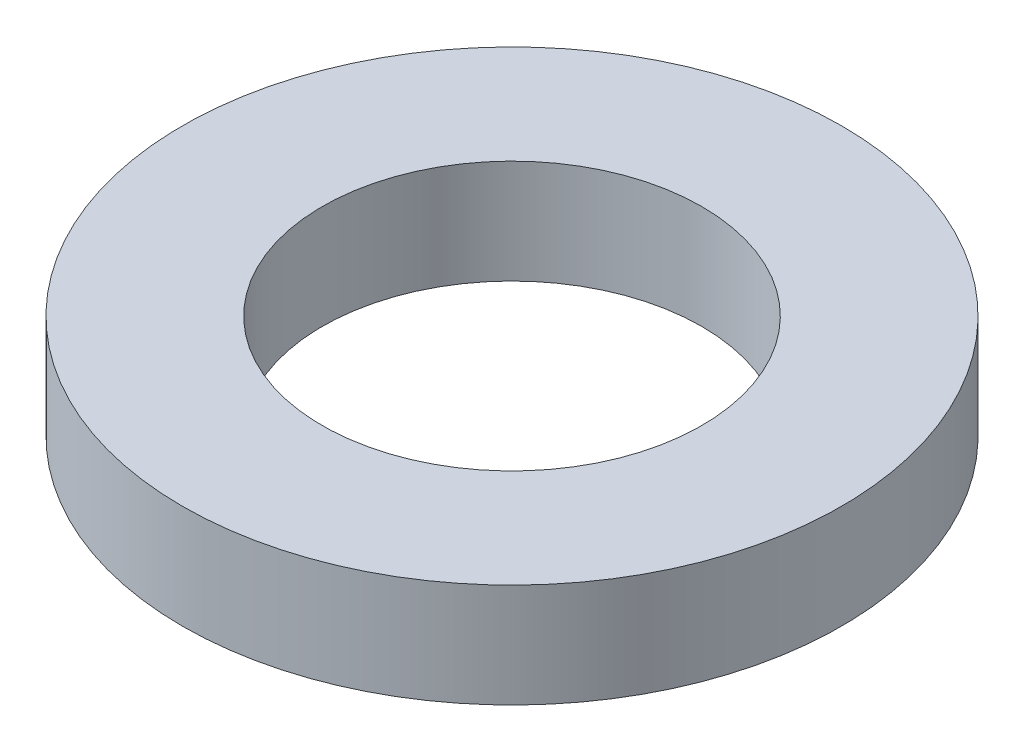
ISO-10303-21;
HEADER;
FILE_DESCRIPTION(('STEP AP214'),'2;1');
FILE_NAME('part.step','',(''),(''),'','','');
FILE_SCHEMA(('AUTOMOTIVE_DESIGN { 1 0 10303 214 1 1 1 1 }'));
ENDSEC;
DATA;
#1=APPLICATION_CONTEXT('core data for automotive mechanical design processes');
#2=APPLICATION_PROTOCOL_DEFINITION('international standard','automotive_design',2000,#1);
#3=PRODUCT_CONTEXT('',#1,'mechanical');
#4=PRODUCT('Part','Part','',(#3));
#5=PRODUCT_RELATED_PRODUCT_CATEGORY('part','',(#4));
#6=PRODUCT_DEFINITION_FORMATION('','',#4);
#7=PRODUCT_DEFINITION_CONTEXT('part definition',#1,'design');
#8=PRODUCT_DEFINITION('design','',#6,#7);
#9=PRODUCT_DEFINITION_SHAPE('','',#8);
#10=(LENGTH_UNIT() NAMED_UNIT(*) SI_UNIT(.MILLI.,.METRE.));
#11=(NAMED_UNIT(*) PLANE_ANGLE_UNIT() SI_UNIT($,.RADIAN.));
#12=(NAMED_UNIT(*) SI_UNIT($,.STERADIAN.) SOLID_ANGLE_UNIT());
#13=UNCERTAINTY_MEASURE_WITH_UNIT(LENGTH_MEASURE(1.E-05),#10,'distance_accuracy_value','');
#14=(GEOMETRIC_REPRESENTATION_CONTEXT(3) GLOBAL_UNCERTAINTY_ASSIGNED_CONTEXT((#13)) GLOBAL_UNIT_ASSIGNED_CONTEXT((#10,
#11,#12)) REPRESENTATION_CONTEXT('',''));
#15=CARTESIAN_POINT('',(0.,0.,0.));
#16=DIRECTION('',(0.,0.,1.));
#17=DIRECTION('',(1.,0.,0.));
#18=AXIS2_PLACEMENT_3D('',#15,#16,#17);
#19=CARTESIAN_POINT('',(0.,26.,0.));
#20=DIRECTION('',(0.,-1.,0.));
#21=DIRECTION('',(0.,0.,-1.));
#22=AXIS2_PLACEMENT_3D('',#19,#20,#21);
#23=CYLINDRICAL_SURFACE('',#22,82.5);
#24=CARTESIAN_POINT('',(0.,26.,0.));
#25=DIRECTION('',(0.,1.,0.));
#26=DIRECTION('',(0.,0.,1.));
#27=AXIS2_PLACEMENT_3D('',#24,#25,#26);
#28=CIRCLE('',#27,82.5);
#29=CARTESIAN_POINT('',(0.,26.,-82.5));
#30=VERTEX_POINT('',#29);
#31=EDGE_CURVE('E10',#30,#30,#28,.T.);
#32=CARTESIAN_POINT('',(0.,0.,0.));
#33=DIRECTION('',(0.,1.,0.));
#34=DIRECTION('',(0.,0.,1.));
#35=AXIS2_PLACEMENT_3D('',#32,#33,#34);
#36=CIRCLE('',#35,82.5);
#37=CARTESIAN_POINT('',(0.,0.,-82.5));
#38=VERTEX_POINT('',#37);
#39=EDGE_CURVE('E37',#38,#38,#36,.T.);
#40=CARTESIAN_POINT('',(0.,26.,-82.5));
#41=CARTESIAN_POINT('',(0.,25.7291666666667,-82.5));
#42=CARTESIAN_POINT('',(0.,25.4583333333333,-82.5));
#43=CARTESIAN_POINT('',(0.,24.9166666666667,-82.5));
#44=CARTESIAN_POINT('',(0.,24.6458333333333,-82.5));
#45=CARTESIAN_POINT('',(0.,24.1041666666667,-82.5));
#46=CARTESIAN_POINT('',(0.,23.8333333333333,-82.5));
#47=CARTESIAN_POINT('',(0.,23.2916666666667,-82.5));
#48=CARTESIAN_POINT('',(0.,23.0208333333333,-82.5));
#49=CARTESIAN_POINT('',(0.,22.4791666666667,-82.5));
#50=CARTESIAN_POINT('',(0.,22.2083333333333,-82.5));
#51=CARTESIAN_POINT('',(0.,21.6666666666667,-82.5));
#52=CARTESIAN_POINT('',(0.,21.3958333333333,-82.5));
#53=CARTESIAN_POINT('',(0.,20.8541666666667,-82.5));
#54=CARTESIAN_POINT('',(0.,20.5833333333333,-82.5));
#55=CARTESIAN_POINT('',(0.,20.0416666666667,-82.5));
#56=CARTESIAN_POINT('',(0.,19.7708333333333,-82.5));
#57=CARTESIAN_POINT('',(0.,19.2291666666667,-82.5));
#58=CARTESIAN_POINT('',(0.,18.9583333333333,-82.5));
#59=CARTESIAN_POINT('',(0.,18.4166666666667,-82.5));
#60=CARTESIAN_POINT('',(0.,18.1458333333333,-82.5));
#61=CARTESIAN_POINT('',(0.,17.6041666666667,-82.5));
#62=CARTESIAN_POINT('',(0.,17.3333333333333,-82.5));
#63=CARTESIAN_POINT('',(0.,16.7916666666667,-82.5));
#64=CARTESIAN_POINT('',(0.,16.5208333333333,-82.5));
#65=CARTESIAN_POINT('',(0.,15.9791666666667,-82.5));
#66=CARTESIAN_POINT('',(0.,15.7083333333333,-82.5));
#67=CARTESIAN_POINT('',(0.,15.1666666666667,-82.5));
#68=CARTESIAN_POINT('',(0.,14.8958333333333,-82.5));
#69=CARTESIAN_POINT('',(0.,14.3541666666667,-82.5));
#70=CARTESIAN_POINT('',(0.,14.0833333333333,-82.5));
#71=CARTESIAN_POINT('',(0.,13.5416666666667,-82.5));
#72=CARTESIAN_POINT('',(0.,13.2708333333333,-82.5));
#73=CARTESIAN_POINT('',(0.,12.7291666666667,-82.5));
#74=CARTESIAN_POINT('',(0.,12.4583333333333,-82.5));
#75=CARTESIAN_POINT('',(0.,11.9166666666667,-82.5));
#76=CARTESIAN_POINT('',(0.,11.6458333333333,-82.5));
#77=CARTESIAN_POINT('',(0.,11.1041666666667,-82.5));
#78=CARTESIAN_POINT('',(0.,10.8333333333333,-82.5));
#79=CARTESIAN_POINT('',(0.,10.2916666666667,-82.5));
#80=CARTESIAN_POINT('',(0.,10.0208333333333,-82.5));
#81=CARTESIAN_POINT('',(0.,9.47916666666667,-82.5));
#82=CARTESIAN_POINT('',(0.,9.20833333333333,-82.5));
#83=CARTESIAN_POINT('',(0.,8.66666666666667,-82.5));
#84=CARTESIAN_POINT('',(0.,8.39583333333333,-82.5));
#85=CARTESIAN_POINT('',(0.,7.85416666666667,-82.5));
#86=CARTESIAN_POINT('',(0.,7.58333333333333,-82.5));
#87=CARTESIAN_POINT('',(0.,7.04166666666667,-82.5));
#88=CARTESIAN_POINT('',(0.,6.77083333333333,-82.5));
#89=CARTESIAN_POINT('',(0.,6.22916666666667,-82.5));
#90=CARTESIAN_POINT('',(0.,5.95833333333333,-82.5));
#91=CARTESIAN_POINT('',(0.,5.41666666666667,-82.5));
#92=CARTESIAN_POINT('',(0.,5.14583333333333,-82.5));
#93=CARTESIAN_POINT('',(0.,4.60416666666667,-82.5));
#94=CARTESIAN_POINT('',(0.,4.33333333333333,-82.5));
#95=CARTESIAN_POINT('',(0.,3.79166666666667,-82.5));
#96=CARTESIAN_POINT('',(0.,3.52083333333333,-82.5));
#97=CARTESIAN_POINT('',(0.,2.97916666666667,-82.5));
#98=CARTESIAN_POINT('',(0.,2.70833333333333,-82.5));
#99=CARTESIAN_POINT('',(0.,2.16666666666667,-82.5));
#100=CARTESIAN_POINT('',(0.,1.89583333333333,-82.5));
#101=CARTESIAN_POINT('',(0.,1.35416666666667,-82.5));
#102=CARTESIAN_POINT('',(0.,1.08333333333333,-82.5));
#103=CARTESIAN_POINT('',(0.,0.541666666666667,-82.5));
#104=CARTESIAN_POINT('',(0.,0.270833333333334,-82.5));
#105=CARTESIAN_POINT('',(0.,0.,-82.5));
#106=B_SPLINE_CURVE_WITH_KNOTS('',3,(#40,#41,#42,#43,#44,#45,#46,#47,#48,#49,#50,#51,#52,#53,
#54,#55,#56,#57,#58,#59,#60,#61,#62,#63,#64,#65,#66,#67,#68,#69,#70,#71,#72,#73,#74,#75,#76,#77,
#78,#79,#80,#81,#82,#83,#84,#85,#86,#87,#88,#89,#90,#91,#92,#93,#94,#95,#96,#97,#98,#99,#100,
#101,#102,#103,#104,#105),.UNSPECIFIED.,.F.,.F.,(4,2,2,2,2,2,2,2,2,2,2,2,2,2,2,2,2,2,2,2,2,2,2,
2,2,2,2,2,2,2,2,2,4),(0.,0.812500000000001,1.625,2.4375,3.25,4.0625,4.875,5.6875,6.5,7.3125,
8.125,8.9375,9.75,10.5625,11.375,12.1875,13.,13.8125,14.625,15.4375,16.25,17.0625,17.875,
18.6875,19.5,20.3125,21.125,21.9375,22.75,23.5625,24.375,25.1875,26.),.UNSPECIFIED.);
#107=EDGE_CURVE('BSEAM40',#30,#38,#106,.T.);
#108=ORIENTED_EDGE('',*,*,#31,.F.);
#109=ORIENTED_EDGE('',*,*,#39,.T.);
#110=ORIENTED_EDGE('',*,*,#107,.T.);
#111=ORIENTED_EDGE('',*,*,#107,.F.);
#112=EDGE_LOOP('',(#108,#110,#109,#111));
#113=FACE_BOUND('',#112,.T.);
#114=ADVANCED_FACE('F40',(#113),#23,.T.);
#115=CARTESIAN_POINT('',(0.,26.,0.));
#116=DIRECTION('',(0.,1.,0.));
#117=DIRECTION('',(0.,0.,1.));
#118=AXIS2_PLACEMENT_3D('',#115,#116,#117);
#119=PLANE('',#118);
#120=CARTESIAN_POINT('',(0.,26.,0.));
#121=DIRECTION('',(0.,1.,0.));
#122=DIRECTION('',(0.,0.,1.));
#123=AXIS2_PLACEMENT_3D('',#120,#121,#122);
#124=CIRCLE('',#123,47.5);
#125=CARTESIAN_POINT('',(0.,26.,-47.5));
#126=VERTEX_POINT('',#125);
#127=EDGE_CURVE('E50',#126,#126,#124,.T.);
#128=ORIENTED_EDGE('',*,*,#127,.F.);
#129=EDGE_LOOP('',(#128));
#130=FACE_BOUND('',#129,.T.);
#131=ORIENTED_EDGE('',*,*,#31,.T.);
#132=EDGE_LOOP('',(#131));
#133=FACE_BOUND('',#132,.T.);
#134=ADVANCED_FACE('F59',(#130,#133),#119,.T.);
#135=CARTESIAN_POINT('',(0.,0.,0.));
#136=DIRECTION('',(0.,1.,0.));
#137=DIRECTION('',(0.,0.,1.));
#138=AXIS2_PLACEMENT_3D('',#135,#136,#137);
#139=PLANE('',#138);
#140=CARTESIAN_POINT('',(0.,0.,0.));
#141=DIRECTION('',(0.,1.,0.));
#142=DIRECTION('',(0.,0.,1.));
#143=AXIS2_PLACEMENT_3D('',#140,#141,#142);
#144=CIRCLE('',#143,47.5);
#145=CARTESIAN_POINT('',(0.,0.,-47.5));
#146=VERTEX_POINT('',#145);
#147=EDGE_CURVE('E47',#146,#146,#144,.T.);
#148=ORIENTED_EDGE('',*,*,#147,.T.);
#149=EDGE_LOOP('',(#148));
#150=FACE_BOUND('',#149,.T.);
#151=ORIENTED_EDGE('',*,*,#39,.F.);
#152=EDGE_LOOP('',(#151));
#153=FACE_BOUND('',#152,.T.);
#154=ADVANCED_FACE('F58',(#150,#153),#139,.F.);
#155=CARTESIAN_POINT('',(0.,26.,0.));
#156=DIRECTION('',(0.,-1.,0.));
#157=DIRECTION('',(0.,0.,-1.));
#158=AXIS2_PLACEMENT_3D('',#155,#156,#157);
#159=CYLINDRICAL_SURFACE('',#158,47.5);
#160=CARTESIAN_POINT('',(0.,26.,-47.5));
#161=CARTESIAN_POINT('',(0.,25.7291666666667,-47.5));
#162=CARTESIAN_POINT('',(0.,25.4583333333333,-47.5));
#163=CARTESIAN_POINT('',(0.,24.9166666666667,-47.5));
#164=CARTESIAN_POINT('',(0.,24.6458333333333,-47.5));
#165=CARTESIAN_POINT('',(0.,24.1041666666667,-47.5));
#166=CARTESIAN_POINT('',(0.,23.8333333333333,-47.5));
#167=CARTESIAN_POINT('',(0.,23.2916666666667,-47.5));
#168=CARTESIAN_POINT('',(0.,23.0208333333333,-47.5));
#169=CARTESIAN_POINT('',(0.,22.4791666666667,-47.5));
#170=CARTESIAN_POINT('',(0.,22.2083333333333,-47.5));
#171=CARTESIAN_POINT('',(0.,21.6666666666667,-47.5));
#172=CARTESIAN_POINT('',(0.,21.3958333333333,-47.5));
#173=CARTESIAN_POINT('',(0.,20.8541666666667,-47.5));
#174=CARTESIAN_POINT('',(0.,20.5833333333333,-47.5));
#175=CARTESIAN_POINT('',(0.,20.0416666666667,-47.5));
#176=CARTESIAN_POINT('',(0.,19.7708333333333,-47.5));
#177=CARTESIAN_POINT('',(0.,19.2291666666667,-47.5));
#178=CARTESIAN_POINT('',(0.,18.9583333333333,-47.5));
#179=CARTESIAN_POINT('',(0.,18.4166666666667,-47.5));
#180=CARTESIAN_POINT('',(0.,18.1458333333333,-47.5));
#181=CARTESIAN_POINT('',(0.,17.6041666666667,-47.5));
#182=CARTESIAN_POINT('',(0.,17.3333333333333,-47.5));
#183=CARTESIAN_POINT('',(0.,16.7916666666667,-47.5));
#184=CARTESIAN_POINT('',(0.,16.5208333333333,-47.5));
#185=CARTESIAN_POINT('',(0.,15.9791666666667,-47.5));
#186=CARTESIAN_POINT('',(0.,15.7083333333333,-47.5));
#187=CARTESIAN_POINT('',(0.,15.1666666666667,-47.5));
#188=CARTESIAN_POINT('',(0.,14.8958333333333,-47.5));
#189=CARTESIAN_POINT('',(0.,14.3541666666667,-47.5));
#190=CARTESIAN_POINT('',(0.,14.0833333333333,-47.5));
#191=CARTESIAN_POINT('',(0.,13.5416666666667,-47.5));
#192=CARTESIAN_POINT('',(0.,13.2708333333333,-47.5));
#193=CARTESIAN_POINT('',(0.,12.7291666666667,-47.5));
#194=CARTESIAN_POINT('',(0.,12.4583333333333,-47.5));
#195=CARTESIAN_POINT('',(0.,11.9166666666667,-47.5));
#196=CARTESIAN_POINT('',(0.,11.6458333333333,-47.5));
#197=CARTESIAN_POINT('',(0.,11.1041666666667,-47.5));
#198=CARTESIAN_POINT('',(0.,10.8333333333333,-47.5));
#199=CARTESIAN_POINT('',(0.,10.2916666666667,-47.5));
#200=CARTESIAN_POINT('',(0.,10.0208333333333,-47.5));
#201=CARTESIAN_POINT('',(0.,9.47916666666667,-47.5));
#202=CARTESIAN_POINT('',(0.,9.20833333333333,-47.5));
#203=CARTESIAN_POINT('',(0.,8.66666666666667,-47.5));
#204=CARTESIAN_POINT('',(0.,8.39583333333333,-47.5));
#205=CARTESIAN_POINT('',(0.,7.85416666666667,-47.5));
#206=CARTESIAN_POINT('',(0.,7.58333333333333,-47.5));
#207=CARTESIAN_POINT('',(0.,7.04166666666667,-47.5));
#208=CARTESIAN_POINT('',(0.,6.77083333333333,-47.5));
#209=CARTESIAN_POINT('',(0.,6.22916666666667,-47.5));
#210=CARTESIAN_POINT('',(0.,5.95833333333333,-47.5));
#211=CARTESIAN_POINT('',(0.,5.41666666666667,-47.5));
#212=CARTESIAN_POINT('',(0.,5.14583333333333,-47.5));
#213=CARTESIAN_POINT('',(0.,4.60416666666667,-47.5));
#214=CARTESIAN_POINT('',(0.,4.33333333333333,-47.5));
#215=CARTESIAN_POINT('',(0.,3.79166666666667,-47.5));
#216=CARTESIAN_POINT('',(0.,3.52083333333333,-47.5));
#217=CARTESIAN_POINT('',(0.,2.97916666666667,-47.5));
#218=CARTESIAN_POINT('',(0.,2.70833333333333,-47.5));
#219=CARTESIAN_POINT('',(0.,2.16666666666667,-47.5));
#220=CARTESIAN_POINT('',(0.,1.89583333333333,-47.5));
#221=CARTESIAN_POINT('',(0.,1.35416666666667,-47.5));
#222=CARTESIAN_POINT('',(0.,1.08333333333333,-47.5));
#223=CARTESIAN_POINT('',(0.,0.541666666666667,-47.5));
#224=CARTESIAN_POINT('',(0.,0.270833333333334,-47.5));
#225=CARTESIAN_POINT('',(0.,0.,-47.5));
#226=B_SPLINE_CURVE_WITH_KNOTS('',3,(#160,#161,#162,#163,#164,#165,#166,#167,#168,#169,#170,
#171,#172,#173,#174,#175,#176,#177,#178,#179,#180,#181,#182,#183,#184,#185,#186,#187,#188,#189,
#190,#191,#192,#193,#194,#195,#196,#197,#198,#199,#200,#201,#202,#203,#204,#205,#206,#207,#208,
#209,#210,#211,#212,#213,#214,#215,#216,#217,#218,#219,#220,#221,#222,#223,#224,#225),
.UNSPECIFIED.,.F.,.F.,(4,2,2,2,2,2,2,2,2,2,2,2,2,2,2,2,2,2,2,2,2,2,2,2,2,2,2,2,2,2,2,2,4),(0.,
0.812500000000001,1.625,2.4375,3.25,4.0625,4.875,5.6875,6.5,7.3125,8.125,8.9375,9.75,10.5625,
11.375,12.1875,13.,13.8125,14.625,15.4375,16.25,17.0625,17.875,18.6875,19.5,20.3125,21.125,
21.9375,22.75,23.5625,24.375,25.1875,26.),.UNSPECIFIED.);
#227=EDGE_CURVE('BSEAM54',#126,#146,#226,.T.);
#228=ORIENTED_EDGE('',*,*,#127,.T.);
#229=ORIENTED_EDGE('',*,*,#147,.F.);
#230=ORIENTED_EDGE('',*,*,#227,.T.);
#231=ORIENTED_EDGE('',*,*,#227,.F.);
#232=EDGE_LOOP('',(#228,#230,#229,#231));
#233=FACE_BOUND('',#232,.T.);
#234=ADVANCED_FACE('F54',(#233),#159,.F.);
#235=CLOSED_SHELL('',(#114,#134,#154,#234));
#236=MANIFOLD_SOLID_BREP('B2',#235);
#237=ADVANCED_BREP_SHAPE_REPRESENTATION('',(#18,#236),#14);
#238=SHAPE_DEFINITION_REPRESENTATION(#9,#237);
ENDSEC;
END-ISO-10303-21;
